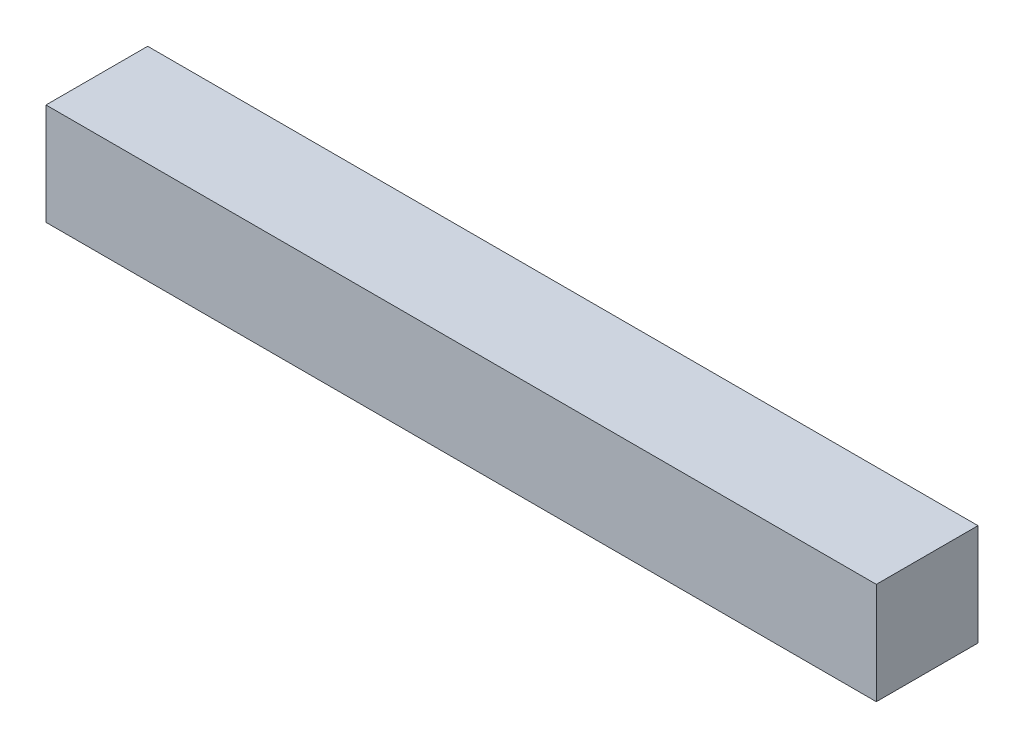
ISO-10303-21;
HEADER;
FILE_DESCRIPTION(('STEP AP214'),'2;1');
FILE_NAME('part.step','',(''),(''),'','','');
FILE_SCHEMA(('AUTOMOTIVE_DESIGN { 1 0 10303 214 1 1 1 1 }'));
ENDSEC;
DATA;
#1=APPLICATION_CONTEXT('core data for automotive mechanical design processes');
#2=APPLICATION_PROTOCOL_DEFINITION('international standard','automotive_design',2000,#1);
#3=PRODUCT_CONTEXT('',#1,'mechanical');
#4=PRODUCT('Part','Part','',(#3));
#5=PRODUCT_RELATED_PRODUCT_CATEGORY('part','',(#4));
#6=PRODUCT_DEFINITION_FORMATION('','',#4);
#7=PRODUCT_DEFINITION_CONTEXT('part definition',#1,'design');
#8=PRODUCT_DEFINITION('design','',#6,#7);
#9=PRODUCT_DEFINITION_SHAPE('','',#8);
#10=(LENGTH_UNIT() NAMED_UNIT(*) SI_UNIT(.MILLI.,.METRE.));
#11=(NAMED_UNIT(*) PLANE_ANGLE_UNIT() SI_UNIT($,.RADIAN.));
#12=(NAMED_UNIT(*) SI_UNIT($,.STERADIAN.) SOLID_ANGLE_UNIT());
#13=UNCERTAINTY_MEASURE_WITH_UNIT(LENGTH_MEASURE(1.E-05),#10,'distance_accuracy_value','');
#14=(GEOMETRIC_REPRESENTATION_CONTEXT(3) GLOBAL_UNCERTAINTY_ASSIGNED_CONTEXT((#13)) GLOBAL_UNIT_ASSIGNED_CONTEXT((#10,
#11,#12)) REPRESENTATION_CONTEXT('',''));
#15=CARTESIAN_POINT('',(0.,0.,0.));
#16=DIRECTION('',(0.,0.,1.));
#17=DIRECTION('',(1.,0.,0.));
#18=AXIS2_PLACEMENT_3D('',#15,#16,#17);
#19=CARTESIAN_POINT('',(0.,3.,0.));
#20=DIRECTION('',(1.,0.,0.));
#21=DIRECTION('',(0.,0.,-1.));
#22=AXIS2_PLACEMENT_3D('',#19,#20,#21);
#23=PLANE('',#22);
#24=DIRECTION('',(0.,0.,1.));
#25=VECTOR('',#24,1.);
#26=CARTESIAN_POINT('',(0.,0.,0.));
#27=LINE('',#26,#25);
#28=CARTESIAN_POINT('',(0.,0.,-3.));
#29=VERTEX_POINT('',#28);
#30=CARTESIAN_POINT('',(0.,0.,0.));
#31=VERTEX_POINT('',#30);
#32=EDGE_CURVE('E102',#29,#31,#27,.T.);
#33=ORIENTED_EDGE('',*,*,#32,.T.);
#34=DIRECTION('',(0.,-1.,0.));
#35=VECTOR('',#34,1.);
#36=CARTESIAN_POINT('',(0.,3.,0.));
#37=LINE('',#36,#35);
#38=CARTESIAN_POINT('',(0.,3.,0.));
#39=VERTEX_POINT('',#38);
#40=EDGE_CURVE('E11',#39,#31,#37,.T.);
#41=ORIENTED_EDGE('',*,*,#40,.F.);
#42=DIRECTION('',(0.,0.,1.));
#43=VECTOR('',#42,1.);
#44=CARTESIAN_POINT('',(0.,3.,0.));
#45=LINE('',#44,#43);
#46=CARTESIAN_POINT('',(0.,3.,-3.));
#47=VERTEX_POINT('',#46);
#48=EDGE_CURVE('E90',#47,#39,#45,.T.);
#49=ORIENTED_EDGE('',*,*,#48,.F.);
#50=DIRECTION('',(0.,-1.,0.));
#51=VECTOR('',#50,1.);
#52=CARTESIAN_POINT('',(0.,3.,-3.));
#53=LINE('',#52,#51);
#54=EDGE_CURVE('E98',#47,#29,#53,.T.);
#55=ORIENTED_EDGE('',*,*,#54,.T.);
#56=EDGE_LOOP('',(#33,#41,#49,#55));
#57=FACE_BOUND('',#56,.T.);
#58=ADVANCED_FACE('F39',(#57),#23,.F.);
#59=CARTESIAN_POINT('',(0.,3.,0.));
#60=DIRECTION('',(0.,0.,-1.));
#61=DIRECTION('',(-1.,0.,0.));
#62=AXIS2_PLACEMENT_3D('',#59,#60,#61);
#63=PLANE('',#62);
#64=DIRECTION('',(1.,0.,0.));
#65=VECTOR('',#64,1.);
#66=CARTESIAN_POINT('',(0.,0.,0.));
#67=LINE('',#66,#65);
#68=CARTESIAN_POINT('',(24.5,0.,0.));
#69=VERTEX_POINT('',#68);
#70=EDGE_CURVE('E94',#31,#69,#67,.T.);
#71=ORIENTED_EDGE('',*,*,#70,.T.);
#72=DIRECTION('',(0.,-1.,0.));
#73=VECTOR('',#72,1.);
#74=CARTESIAN_POINT('',(24.5,3.,0.));
#75=LINE('',#74,#73);
#76=CARTESIAN_POINT('',(24.5,3.,0.));
#77=VERTEX_POINT('',#76);
#78=EDGE_CURVE('E47',#77,#69,#75,.T.);
#79=ORIENTED_EDGE('',*,*,#78,.F.);
#80=DIRECTION('',(1.,0.,0.));
#81=VECTOR('',#80,1.);
#82=CARTESIAN_POINT('',(0.,3.,0.));
#83=LINE('',#82,#81);
#84=EDGE_CURVE('E85',#39,#77,#83,.T.);
#85=ORIENTED_EDGE('',*,*,#84,.F.);
#86=ORIENTED_EDGE('',*,*,#40,.T.);
#87=EDGE_LOOP('',(#71,#79,#85,#86));
#88=FACE_BOUND('',#87,.T.);
#89=ADVANCED_FACE('F93',(#88),#63,.F.);
#90=CARTESIAN_POINT('',(24.5,3.,0.));
#91=DIRECTION('',(-1.,0.,0.));
#92=DIRECTION('',(0.,0.,1.));
#93=AXIS2_PLACEMENT_3D('',#90,#91,#92);
#94=PLANE('',#93);
#95=DIRECTION('',(0.,0.,-1.));
#96=VECTOR('',#95,1.);
#97=CARTESIAN_POINT('',(24.5,0.,0.));
#98=LINE('',#97,#96);
#99=CARTESIAN_POINT('',(24.5,0.,-3.));
#100=VERTEX_POINT('',#99);
#101=EDGE_CURVE('E72',#69,#100,#98,.T.);
#102=ORIENTED_EDGE('',*,*,#101,.T.);
#103=DIRECTION('',(0.,-1.,0.));
#104=VECTOR('',#103,1.);
#105=CARTESIAN_POINT('',(24.5,3.,-3.));
#106=LINE('',#105,#104);
#107=CARTESIAN_POINT('',(24.5,3.,-3.));
#108=VERTEX_POINT('',#107);
#109=EDGE_CURVE('E95',#108,#100,#106,.T.);
#110=ORIENTED_EDGE('',*,*,#109,.F.);
#111=DIRECTION('',(0.,0.,-1.));
#112=VECTOR('',#111,1.);
#113=CARTESIAN_POINT('',(24.5,3.,0.));
#114=LINE('',#113,#112);
#115=EDGE_CURVE('E88',#77,#108,#114,.T.);
#116=ORIENTED_EDGE('',*,*,#115,.F.);
#117=ORIENTED_EDGE('',*,*,#78,.T.);
#118=EDGE_LOOP('',(#102,#110,#116,#117));
#119=FACE_BOUND('',#118,.T.);
#120=ADVANCED_FACE('F96',(#119),#94,.F.);
#121=CARTESIAN_POINT('',(0.,3.,-3.));
#122=DIRECTION('',(0.,0.,1.));
#123=DIRECTION('',(1.,0.,0.));
#124=AXIS2_PLACEMENT_3D('',#121,#122,#123);
#125=PLANE('',#124);
#126=DIRECTION('',(-1.,0.,0.));
#127=VECTOR('',#126,1.);
#128=CARTESIAN_POINT('',(0.,0.,-3.));
#129=LINE('',#128,#127);
#130=EDGE_CURVE('E78',#100,#29,#129,.T.);
#131=ORIENTED_EDGE('',*,*,#130,.T.);
#132=ORIENTED_EDGE('',*,*,#54,.F.);
#133=DIRECTION('',(-1.,0.,0.));
#134=VECTOR('',#133,1.);
#135=CARTESIAN_POINT('',(0.,3.,-3.));
#136=LINE('',#135,#134);
#137=EDGE_CURVE('E55',#108,#47,#136,.T.);
#138=ORIENTED_EDGE('',*,*,#137,.F.);
#139=ORIENTED_EDGE('',*,*,#109,.T.);
#140=EDGE_LOOP('',(#131,#132,#138,#139));
#141=FACE_BOUND('',#140,.T.);
#142=ADVANCED_FACE('F109',(#141),#125,.F.);
#143=CARTESIAN_POINT('',(0.,3.,0.));
#144=DIRECTION('',(0.,-1.,0.));
#145=DIRECTION('',(0.,0.,-1.));
#146=AXIS2_PLACEMENT_3D('',#143,#144,#145);
#147=PLANE('',#146);
#148=ORIENTED_EDGE('',*,*,#48,.T.);
#149=ORIENTED_EDGE('',*,*,#84,.T.);
#150=ORIENTED_EDGE('',*,*,#115,.T.);
#151=ORIENTED_EDGE('',*,*,#137,.T.);
#152=EDGE_LOOP('',(#148,#149,#150,#151));
#153=FACE_BOUND('',#152,.T.);
#154=ADVANCED_FACE('F86',(#153),#147,.F.);
#155=CARTESIAN_POINT('',(0.,0.,0.));
#156=DIRECTION('',(0.,-1.,0.));
#157=DIRECTION('',(0.,0.,-1.));
#158=AXIS2_PLACEMENT_3D('',#155,#156,#157);
#159=PLANE('',#158);
#160=ORIENTED_EDGE('',*,*,#32,.F.);
#161=ORIENTED_EDGE('',*,*,#130,.F.);
#162=ORIENTED_EDGE('',*,*,#101,.F.);
#163=ORIENTED_EDGE('',*,*,#70,.F.);
#164=EDGE_LOOP('',(#160,#161,#162,#163));
#165=FACE_BOUND('',#164,.T.);
#166=ADVANCED_FACE('F112',(#165),#159,.T.);
#167=CLOSED_SHELL('',(#58,#89,#120,#142,#154,#166));
#168=MANIFOLD_SOLID_BREP('B2',#167);
#169=ADVANCED_BREP_SHAPE_REPRESENTATION('',(#18,#168),#14);
#170=SHAPE_DEFINITION_REPRESENTATION(#9,#169);
ENDSEC;
END-ISO-10303-21;
